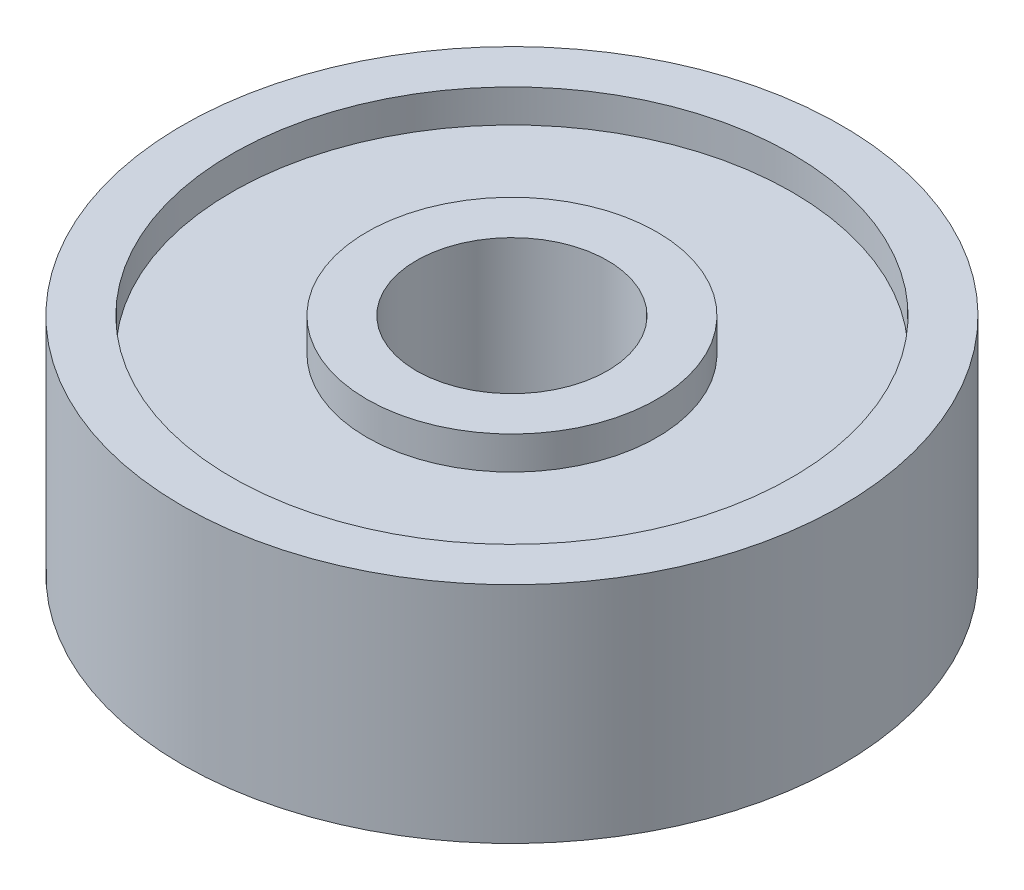
ISO-10303-21;
HEADER;
FILE_DESCRIPTION(('STEP AP214'),'2;1');
FILE_NAME('part.step','',(''),(''),'','','');
FILE_SCHEMA(('AUTOMOTIVE_DESIGN { 1 0 10303 214 1 1 1 1 }'));
ENDSEC;
DATA;
#1=APPLICATION_CONTEXT('core data for automotive mechanical design processes');
#2=APPLICATION_PROTOCOL_DEFINITION('international standard','automotive_design',2000,#1);
#3=PRODUCT_CONTEXT('',#1,'mechanical');
#4=PRODUCT('Part','Part','',(#3));
#5=PRODUCT_RELATED_PRODUCT_CATEGORY('part','',(#4));
#6=PRODUCT_DEFINITION_FORMATION('','',#4);
#7=PRODUCT_DEFINITION_CONTEXT('part definition',#1,'design');
#8=PRODUCT_DEFINITION('design','',#6,#7);
#9=PRODUCT_DEFINITION_SHAPE('','',#8);
#10=(LENGTH_UNIT() NAMED_UNIT(*) SI_UNIT(.MILLI.,.METRE.));
#11=(NAMED_UNIT(*) PLANE_ANGLE_UNIT() SI_UNIT($,.RADIAN.));
#12=(NAMED_UNIT(*) SI_UNIT($,.STERADIAN.) SOLID_ANGLE_UNIT());
#13=UNCERTAINTY_MEASURE_WITH_UNIT(LENGTH_MEASURE(1.E-05),#10,'distance_accuracy_value','');
#14=(GEOMETRIC_REPRESENTATION_CONTEXT(3) GLOBAL_UNCERTAINTY_ASSIGNED_CONTEXT((#13)) GLOBAL_UNIT_ASSIGNED_CONTEXT((#10,
#11,#12)) REPRESENTATION_CONTEXT('',''));
#15=CARTESIAN_POINT('',(0.,0.,0.));
#16=DIRECTION('',(0.,0.,1.));
#17=DIRECTION('',(1.,0.,0.));
#18=AXIS2_PLACEMENT_3D('',#15,#16,#17);
#19=CARTESIAN_POINT('',(0.,34.,0.));
#20=DIRECTION('',(0.,1.,0.));
#21=DIRECTION('',(0.,0.,1.));
#22=AXIS2_PLACEMENT_3D('',#19,#20,#21);
#23=PLANE('',#22);
#24=CARTESIAN_POINT('',(0.,34.,0.));
#25=DIRECTION('',(0.,1.,0.));
#26=DIRECTION('',(0.,0.,1.));
#27=AXIS2_PLACEMENT_3D('',#24,#25,#26);
#28=CIRCLE('',#27,29.);
#29=CARTESIAN_POINT('',(0.,34.,29.));
#30=VERTEX_POINT('',#29);
#31=EDGE_CURVE('E46',#30,#30,#28,.T.);
#32=ORIENTED_EDGE('',*,*,#31,.F.);
#33=EDGE_LOOP('',(#32));
#34=FACE_BOUND('',#33,.T.);
#35=CARTESIAN_POINT('',(0.,34.,0.));
#36=DIRECTION('',(0.,-1.,0.));
#37=DIRECTION('',(0.,0.,-1.));
#38=AXIS2_PLACEMENT_3D('',#35,#36,#37);
#39=CIRCLE('',#38,44.);
#40=CARTESIAN_POINT('',(0.,34.,-44.));
#41=VERTEX_POINT('',#40);
#42=EDGE_CURVE('E72',#41,#41,#39,.T.);
#43=ORIENTED_EDGE('',*,*,#42,.F.);
#44=EDGE_LOOP('',(#43));
#45=FACE_BOUND('',#44,.T.);
#46=ADVANCED_FACE('F35',(#34,#45),#23,.T.);
#47=CARTESIAN_POINT('',(0.,-34.,0.));
#48=DIRECTION('',(0.,1.,0.));
#49=DIRECTION('',(0.,0.,1.));
#50=AXIS2_PLACEMENT_3D('',#47,#48,#49);
#51=PLANE('',#50);
#52=CARTESIAN_POINT('',(0.,-34.,0.));
#53=DIRECTION('',(0.,1.,0.));
#54=DIRECTION('',(0.,0.,1.));
#55=AXIS2_PLACEMENT_3D('',#52,#53,#54);
#56=CIRCLE('',#55,29.);
#57=CARTESIAN_POINT('',(0.,-34.,29.));
#58=VERTEX_POINT('',#57);
#59=EDGE_CURVE('E48',#58,#58,#56,.T.);
#60=ORIENTED_EDGE('',*,*,#59,.T.);
#61=EDGE_LOOP('',(#60));
#62=FACE_BOUND('',#61,.T.);
#63=CARTESIAN_POINT('',(0.,-34.,0.));
#64=DIRECTION('',(0.,-1.,0.));
#65=DIRECTION('',(0.,0.,-1.));
#66=AXIS2_PLACEMENT_3D('',#63,#64,#65);
#67=CIRCLE('',#66,44.);
#68=CARTESIAN_POINT('',(0.,-34.,-44.));
#69=VERTEX_POINT('',#68);
#70=EDGE_CURVE('E60',#69,#69,#67,.T.);
#71=ORIENTED_EDGE('',*,*,#70,.T.);
#72=EDGE_LOOP('',(#71));
#73=FACE_BOUND('',#72,.T.);
#74=ADVANCED_FACE('F88',(#62,#73),#51,.F.);
#75=CARTESIAN_POINT('',(0.,34.,0.));
#76=DIRECTION('',(0.,-1.,0.));
#77=DIRECTION('',(0.,0.,-1.));
#78=AXIS2_PLACEMENT_3D('',#75,#76,#77);
#79=CIRCLE('',#78,85.);
#80=CARTESIAN_POINT('',(0.,34.,-85.));
#81=VERTEX_POINT('',#80);
#82=EDGE_CURVE('E66',#81,#81,#79,.T.);
#83=ORIENTED_EDGE('',*,*,#82,.T.);
#84=EDGE_LOOP('',(#83));
#85=FACE_BOUND('',#84,.T.);
#86=CARTESIAN_POINT('',(0.,34.,0.));
#87=DIRECTION('',(0.,1.,0.));
#88=DIRECTION('',(0.,0.,1.));
#89=AXIS2_PLACEMENT_3D('',#86,#87,#88);
#90=CIRCLE('',#89,100.);
#91=CARTESIAN_POINT('',(0.,34.,100.));
#92=VERTEX_POINT('',#91);
#93=EDGE_CURVE('E10',#92,#92,#90,.T.);
#94=ORIENTED_EDGE('',*,*,#93,.T.);
#95=EDGE_LOOP('',(#94));
#96=FACE_BOUND('',#95,.T.);
#97=ADVANCED_FACE('F91',(#85,#96),#23,.T.);
#98=CARTESIAN_POINT('',(0.,-34.,0.));
#99=DIRECTION('',(0.,-1.,0.));
#100=DIRECTION('',(0.,0.,-1.));
#101=AXIS2_PLACEMENT_3D('',#98,#99,#100);
#102=CIRCLE('',#101,85.);
#103=CARTESIAN_POINT('',(0.,-34.,-85.));
#104=VERTEX_POINT('',#103);
#105=EDGE_CURVE('E54',#104,#104,#102,.T.);
#106=ORIENTED_EDGE('',*,*,#105,.F.);
#107=EDGE_LOOP('',(#106));
#108=FACE_BOUND('',#107,.T.);
#109=CARTESIAN_POINT('',(0.,-34.,0.));
#110=DIRECTION('',(0.,1.,0.));
#111=DIRECTION('',(0.,0.,1.));
#112=AXIS2_PLACEMENT_3D('',#109,#110,#111);
#113=CIRCLE('',#112,100.);
#114=CARTESIAN_POINT('',(0.,-34.,100.));
#115=VERTEX_POINT('',#114);
#116=EDGE_CURVE('E39',#115,#115,#113,.T.);
#117=ORIENTED_EDGE('',*,*,#116,.F.);
#118=EDGE_LOOP('',(#117));
#119=FACE_BOUND('',#118,.T.);
#120=ADVANCED_FACE('F96',(#108,#119),#51,.F.);
#121=CARTESIAN_POINT('',(0.,34.,0.));
#122=DIRECTION('',(0.,-1.,0.));
#123=DIRECTION('',(0.,0.,-1.));
#124=AXIS2_PLACEMENT_3D('',#121,#122,#123);
#125=CYLINDRICAL_SURFACE('',#124,100.);
#126=ORIENTED_EDGE('',*,*,#93,.F.);
#127=EDGE_LOOP('',(#126));
#128=FACE_BOUND('',#127,.T.);
#129=ORIENTED_EDGE('',*,*,#116,.T.);
#130=EDGE_LOOP('',(#129));
#131=FACE_BOUND('',#130,.T.);
#132=ADVANCED_FACE('F37',(#128,#131),#125,.T.);
#133=CARTESIAN_POINT('',(0.,34.,0.));
#134=DIRECTION('',(0.,-1.,0.));
#135=DIRECTION('',(0.,0.,-1.));
#136=AXIS2_PLACEMENT_3D('',#133,#134,#135);
#137=CYLINDRICAL_SURFACE('',#136,29.);
#138=ORIENTED_EDGE('',*,*,#31,.T.);
#139=EDGE_LOOP('',(#138));
#140=FACE_BOUND('',#139,.T.);
#141=ORIENTED_EDGE('',*,*,#59,.F.);
#142=EDGE_LOOP('',(#141));
#143=FACE_BOUND('',#142,.T.);
#144=ADVANCED_FACE('F126',(#140,#143),#137,.F.);
#145=CARTESIAN_POINT('',(0.,-24.,0.));
#146=DIRECTION('',(0.,-1.,0.));
#147=DIRECTION('',(0.,0.,-1.));
#148=AXIS2_PLACEMENT_3D('',#145,#146,#147);
#149=CYLINDRICAL_SURFACE('',#148,85.);
#150=CARTESIAN_POINT('',(0.,-24.,0.));
#151=DIRECTION('',(0.,-1.,0.));
#152=DIRECTION('',(0.,0.,-1.));
#153=AXIS2_PLACEMENT_3D('',#150,#151,#152);
#154=CIRCLE('',#153,85.);
#155=CARTESIAN_POINT('',(0.,-24.,-85.));
#156=VERTEX_POINT('',#155);
#157=EDGE_CURVE('E51',#156,#156,#154,.T.);
#158=ORIENTED_EDGE('',*,*,#157,.F.);
#159=EDGE_LOOP('',(#158));
#160=FACE_BOUND('',#159,.T.);
#161=ORIENTED_EDGE('',*,*,#105,.T.);
#162=EDGE_LOOP('',(#161));
#163=FACE_BOUND('',#162,.T.);
#164=ADVANCED_FACE('F123',(#160,#163),#149,.F.);
#165=CARTESIAN_POINT('',(0.,-24.,0.));
#166=DIRECTION('',(0.,-1.,0.));
#167=DIRECTION('',(0.,0.,-1.));
#168=AXIS2_PLACEMENT_3D('',#165,#166,#167);
#169=PLANE('',#168);
#170=CARTESIAN_POINT('',(0.,-24.,0.));
#171=DIRECTION('',(0.,-1.,0.));
#172=DIRECTION('',(0.,0.,-1.));
#173=AXIS2_PLACEMENT_3D('',#170,#171,#172);
#174=CIRCLE('',#173,44.);
#175=CARTESIAN_POINT('',(0.,-24.,-44.));
#176=VERTEX_POINT('',#175);
#177=EDGE_CURVE('E57',#176,#176,#174,.T.);
#178=ORIENTED_EDGE('',*,*,#177,.F.);
#179=EDGE_LOOP('',(#178));
#180=FACE_BOUND('',#179,.T.);
#181=ORIENTED_EDGE('',*,*,#157,.T.);
#182=EDGE_LOOP('',(#181));
#183=FACE_BOUND('',#182,.T.);
#184=ADVANCED_FACE('F119',(#180,#183),#169,.T.);
#185=CARTESIAN_POINT('',(0.,-24.,0.));
#186=DIRECTION('',(0.,-1.,0.));
#187=DIRECTION('',(0.,0.,-1.));
#188=AXIS2_PLACEMENT_3D('',#185,#186,#187);
#189=CYLINDRICAL_SURFACE('',#188,44.);
#190=ORIENTED_EDGE('',*,*,#177,.T.);
#191=EDGE_LOOP('',(#190));
#192=FACE_BOUND('',#191,.T.);
#193=ORIENTED_EDGE('',*,*,#70,.F.);
#194=EDGE_LOOP('',(#193));
#195=FACE_BOUND('',#194,.T.);
#196=ADVANCED_FACE('F113',(#192,#195),#189,.T.);
#197=CARTESIAN_POINT('',(0.,24.,0.));
#198=DIRECTION('',(0.,1.,0.));
#199=DIRECTION('',(0.,0.,-1.));
#200=AXIS2_PLACEMENT_3D('',#197,#198,#199);
#201=PLANE('',#200);
#202=CARTESIAN_POINT('',(0.,24.,0.));
#203=DIRECTION('',(0.,-1.,0.));
#204=DIRECTION('',(0.,0.,-1.));
#205=AXIS2_PLACEMENT_3D('',#202,#203,#204);
#206=CIRCLE('',#205,85.);
#207=CARTESIAN_POINT('',(0.,24.,-85.));
#208=VERTEX_POINT('',#207);
#209=EDGE_CURVE('E63',#208,#208,#206,.T.);
#210=ORIENTED_EDGE('',*,*,#209,.F.);
#211=EDGE_LOOP('',(#210));
#212=FACE_BOUND('',#211,.T.);
#213=CARTESIAN_POINT('',(0.,24.,0.));
#214=DIRECTION('',(0.,-1.,0.));
#215=DIRECTION('',(0.,0.,-1.));
#216=AXIS2_PLACEMENT_3D('',#213,#214,#215);
#217=CIRCLE('',#216,44.);
#218=CARTESIAN_POINT('',(0.,24.,-44.));
#219=VERTEX_POINT('',#218);
#220=EDGE_CURVE('E69',#219,#219,#217,.T.);
#221=ORIENTED_EDGE('',*,*,#220,.T.);
#222=EDGE_LOOP('',(#221));
#223=FACE_BOUND('',#222,.T.);
#224=ADVANCED_FACE('F78',(#212,#223),#201,.T.);
#225=CARTESIAN_POINT('',(0.,24.,0.));
#226=DIRECTION('',(0.,1.,0.));
#227=DIRECTION('',(0.,0.,1.));
#228=AXIS2_PLACEMENT_3D('',#225,#226,#227);
#229=CYLINDRICAL_SURFACE('',#228,85.);
#230=ORIENTED_EDGE('',*,*,#209,.T.);
#231=EDGE_LOOP('',(#230));
#232=FACE_BOUND('',#231,.T.);
#233=ORIENTED_EDGE('',*,*,#82,.F.);
#234=EDGE_LOOP('',(#233));
#235=FACE_BOUND('',#234,.T.);
#236=ADVANCED_FACE('F83',(#232,#235),#229,.F.);
#237=CARTESIAN_POINT('',(0.,24.,0.));
#238=DIRECTION('',(0.,1.,0.));
#239=DIRECTION('',(0.,0.,1.));
#240=AXIS2_PLACEMENT_3D('',#237,#238,#239);
#241=CYLINDRICAL_SURFACE('',#240,44.);
#242=ORIENTED_EDGE('',*,*,#220,.F.);
#243=EDGE_LOOP('',(#242));
#244=FACE_BOUND('',#243,.T.);
#245=ORIENTED_EDGE('',*,*,#42,.T.);
#246=EDGE_LOOP('',(#245));
#247=FACE_BOUND('',#246,.T.);
#248=ADVANCED_FACE('F80',(#244,#247),#241,.T.);
#249=CLOSED_SHELL('',(#46,#74,#97,#120,#132,#144,#164,#184,#196,#224,#236,#248));
#250=MANIFOLD_SOLID_BREP('B2',#249);
#251=ADVANCED_BREP_SHAPE_REPRESENTATION('',(#18,#250),#14);
#252=SHAPE_DEFINITION_REPRESENTATION(#9,#251);
ENDSEC;
END-ISO-10303-21;
